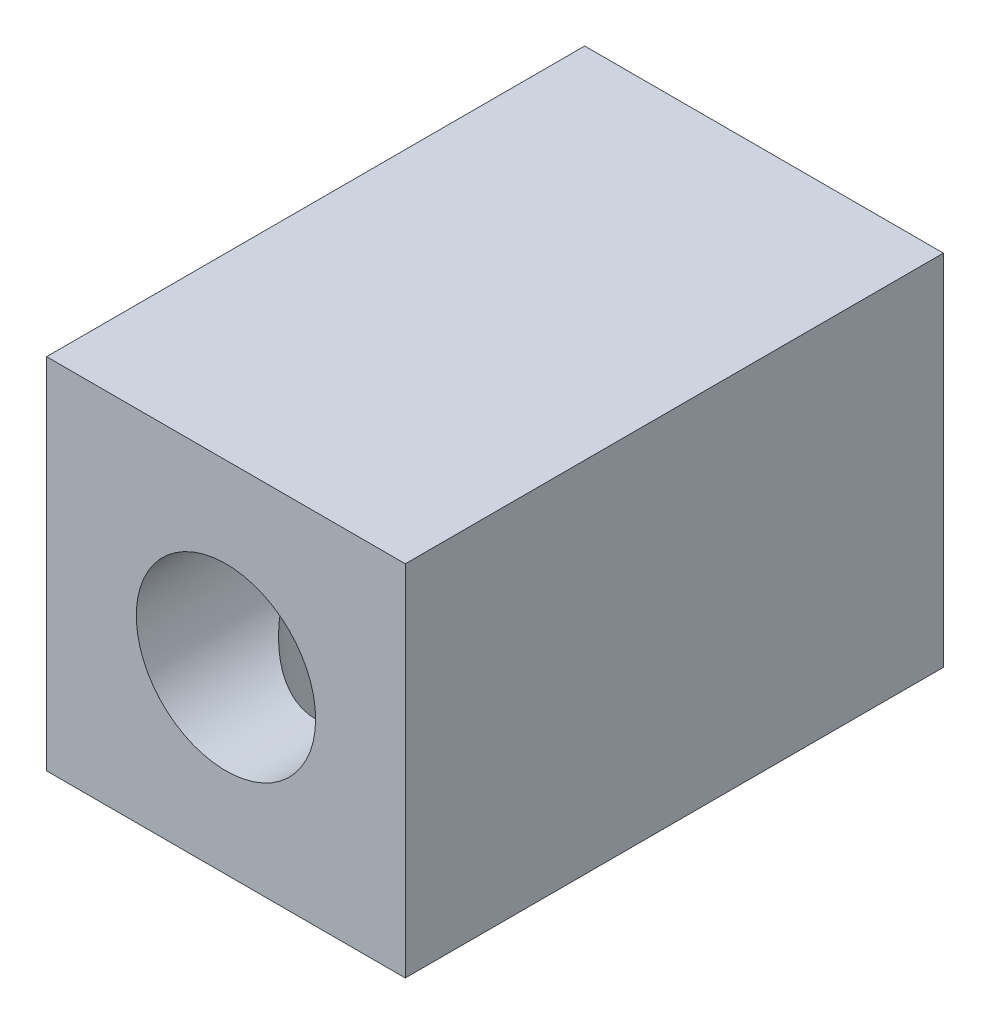
ISO-10303-21;
HEADER;
FILE_DESCRIPTION(('STEP AP214'),'2;1');
FILE_NAME('part.step','',(''),(''),'','','');
FILE_SCHEMA(('AUTOMOTIVE_DESIGN { 1 0 10303 214 1 1 1 1 }'));
ENDSEC;
DATA;
#1=APPLICATION_CONTEXT('core data for automotive mechanical design processes');
#2=APPLICATION_PROTOCOL_DEFINITION('international standard','automotive_design',2000,#1);
#3=PRODUCT_CONTEXT('',#1,'mechanical');
#4=PRODUCT('Part','Part','',(#3));
#5=PRODUCT_RELATED_PRODUCT_CATEGORY('part','',(#4));
#6=PRODUCT_DEFINITION_FORMATION('','',#4);
#7=PRODUCT_DEFINITION_CONTEXT('part definition',#1,'design');
#8=PRODUCT_DEFINITION('design','',#6,#7);
#9=PRODUCT_DEFINITION_SHAPE('','',#8);
#10=(LENGTH_UNIT() NAMED_UNIT(*) SI_UNIT(.MILLI.,.METRE.));
#11=(NAMED_UNIT(*) PLANE_ANGLE_UNIT() SI_UNIT($,.RADIAN.));
#12=(NAMED_UNIT(*) SI_UNIT($,.STERADIAN.) SOLID_ANGLE_UNIT());
#13=UNCERTAINTY_MEASURE_WITH_UNIT(LENGTH_MEASURE(1.E-05),#10,'distance_accuracy_value','');
#14=(GEOMETRIC_REPRESENTATION_CONTEXT(3) GLOBAL_UNCERTAINTY_ASSIGNED_CONTEXT((#13)) GLOBAL_UNIT_ASSIGNED_CONTEXT((#10,
#11,#12)) REPRESENTATION_CONTEXT('',''));
#15=CARTESIAN_POINT('',(0.,0.,0.));
#16=DIRECTION('',(0.,0.,1.));
#17=DIRECTION('',(1.,0.,0.));
#18=AXIS2_PLACEMENT_3D('',#15,#16,#17);
#19=CARTESIAN_POINT('',(-5.,-4.9999999999964,15.));
#20=DIRECTION('',(0.,0.,-1.00000000000002));
#21=DIRECTION('',(-1.00000000000002,0.,0.));
#22=AXIS2_PLACEMENT_3D('',#19,#20,#21);
#23=PLANE('',#22);
#24=DIRECTION('',(0.,-1.,0.));
#25=VECTOR('',#24,1.);
#26=CARTESIAN_POINT('',(-5.,-4.9999999999964,15.));
#27=LINE('',#26,#25);
#28=CARTESIAN_POINT('',(-4.99999999999995,4.99999999999995,15.));
#29=VERTEX_POINT('',#28);
#30=CARTESIAN_POINT('',(-5.,-4.9999999999964,15.));
#31=VERTEX_POINT('',#30);
#32=EDGE_CURVE('E91',#29,#31,#27,.T.);
#33=ORIENTED_EDGE('',*,*,#32,.T.);
#34=DIRECTION('',(1.00000000000002,0.,0.));
#35=VECTOR('',#34,1.);
#36=CARTESIAN_POINT('',(-5.,-4.9999999999964,15.));
#37=LINE('',#36,#35);
#38=CARTESIAN_POINT('',(5.00000000000017,-5.00000000000028,14.9999999999997));
#39=VERTEX_POINT('',#38);
#40=EDGE_CURVE('E93',#31,#39,#37,.T.);
#41=ORIENTED_EDGE('',*,*,#40,.T.);
#42=DIRECTION('',(0.,1.,0.));
#43=VECTOR('',#42,1.);
#44=CARTESIAN_POINT('',(5.00000000000017,-5.00000000000028,14.9999999999997));
#45=LINE('',#44,#43);
#46=CARTESIAN_POINT('',(4.99999999999995,4.99999999999595,14.9999999999993));
#47=VERTEX_POINT('',#46);
#48=EDGE_CURVE('E95',#39,#47,#45,.T.);
#49=ORIENTED_EDGE('',*,*,#48,.T.);
#50=DIRECTION('',(-1.00000000000002,0.,0.));
#51=VECTOR('',#50,1.);
#52=CARTESIAN_POINT('',(-4.99999999999995,4.99999999999995,15.));
#53=LINE('',#52,#51);
#54=EDGE_CURVE('E36',#47,#29,#53,.T.);
#55=ORIENTED_EDGE('',*,*,#54,.T.);
#56=EDGE_LOOP('',(#33,#41,#49,#55));
#57=FACE_BOUND('',#56,.T.);
#58=CARTESIAN_POINT('',(0.,-4.16333634234434E-12,14.9999999999998));
#59=DIRECTION('',(0.,0.,1.00000000000002));
#60=DIRECTION('',(1.00000000000002,0.,0.));
#61=AXIS2_PLACEMENT_3D('',#58,#59,#60);
#62=CIRCLE('',#61,2.5);
#63=CARTESIAN_POINT('',(2.50000000000002,-4.16259908486705E-12,14.9999999999998));
#64=VERTEX_POINT('',#63);
#65=EDGE_CURVE('E71',#64,#64,#62,.T.);
#66=ORIENTED_EDGE('',*,*,#65,.F.);
#67=EDGE_LOOP('',(#66));
#68=FACE_BOUND('',#67,.T.);
#69=ADVANCED_FACE('F16',(#57,#68),#23,.F.);
#70=CARTESIAN_POINT('',(-4.99999999999989,-5.00000000000406,-2.22044604925031E-13));
#71=DIRECTION('',(0.,0.,-1.00000000000002));
#72=DIRECTION('',(-1.00000000000002,0.,0.));
#73=AXIS2_PLACEMENT_3D('',#70,#71,#72);
#74=PLANE('',#73);
#75=DIRECTION('',(0.,-1.,0.));
#76=VECTOR('',#75,1.);
#77=CARTESIAN_POINT('',(-4.99999999999989,-5.00000000000406,-2.22044604925031E-13));
#78=LINE('',#77,#76);
#79=CARTESIAN_POINT('',(-5.00000000000009,4.99999999999601,-2.22044604925031E-13));
#80=VERTEX_POINT('',#79);
#81=CARTESIAN_POINT('',(-4.99999999999989,-5.00000000000406,-2.22044604925031E-13));
#82=VERTEX_POINT('',#81);
#83=EDGE_CURVE('E78',#80,#82,#78,.T.);
#84=ORIENTED_EDGE('',*,*,#83,.F.);
#85=DIRECTION('',(-1.00000000000002,0.,0.));
#86=VECTOR('',#85,1.);
#87=CARTESIAN_POINT('',(-5.00000000000009,4.99999999999601,-2.22044604925031E-13));
#88=LINE('',#87,#86);
#89=CARTESIAN_POINT('',(5.00000000000012,4.99999999999989,-2.22044604925031E-13));
#90=VERTEX_POINT('',#89);
#91=EDGE_CURVE('E89',#90,#80,#88,.T.);
#92=ORIENTED_EDGE('',*,*,#91,.F.);
#93=DIRECTION('',(0.,1.,0.));
#94=VECTOR('',#93,1.);
#95=CARTESIAN_POINT('',(5.,-5.00000000000006,0.));
#96=LINE('',#95,#94);
#97=CARTESIAN_POINT('',(5.,-5.00000000000006,0.));
#98=VERTEX_POINT('',#97);
#99=EDGE_CURVE('E87',#98,#90,#96,.T.);
#100=ORIENTED_EDGE('',*,*,#99,.F.);
#101=DIRECTION('',(1.00000000000002,0.,0.));
#102=VECTOR('',#101,1.);
#103=CARTESIAN_POINT('',(-4.99999999999989,-5.00000000000406,-2.22044604925031E-13));
#104=LINE('',#103,#102);
#105=EDGE_CURVE('E85',#82,#98,#104,.T.);
#106=ORIENTED_EDGE('',*,*,#105,.F.);
#107=EDGE_LOOP('',(#84,#92,#100,#106));
#108=FACE_BOUND('',#107,.T.);
#109=CARTESIAN_POINT('',(0.,-3.71924713249427E-12,1.59594559789866E-13));
#110=DIRECTION('',(0.,0.,1.00000000000002));
#111=DIRECTION('',(1.00000000000002,0.,0.));
#112=AXIS2_PLACEMENT_3D('',#109,#110,#111);
#113=CIRCLE('',#112,2.5);
#114=CARTESIAN_POINT('',(2.49999999999997,-3.71850987501698E-12,1.58501684000001E-13));
#115=VERTEX_POINT('',#114);
#116=EDGE_CURVE('E74',#115,#115,#113,.T.);
#117=ORIENTED_EDGE('',*,*,#116,.T.);
#118=EDGE_LOOP('',(#117));
#119=FACE_BOUND('',#118,.T.);
#120=ADVANCED_FACE('F117',(#108,#119),#74,.T.);
#121=CARTESIAN_POINT('',(-5.,-4.9999999999964,15.));
#122=DIRECTION('',(1.00000000000002,0.,0.));
#123=DIRECTION('',(0.,0.,-1.00000000000002));
#124=AXIS2_PLACEMENT_3D('',#121,#122,#123);
#125=PLANE('',#124);
#126=ORIENTED_EDGE('',*,*,#83,.T.);
#127=DIRECTION('',(0.,0.,-1.00000000000002));
#128=VECTOR('',#127,1.);
#129=CARTESIAN_POINT('',(-5.,-4.9999999999964,15.));
#130=LINE('',#129,#128);
#131=EDGE_CURVE('E62',#31,#82,#130,.T.);
#132=ORIENTED_EDGE('',*,*,#131,.F.);
#133=ORIENTED_EDGE('',*,*,#32,.F.);
#134=DIRECTION('',(0.,0.,-1.00000000000002));
#135=VECTOR('',#134,1.);
#136=CARTESIAN_POINT('',(-4.99999999999995,4.99999999999995,15.));
#137=LINE('',#136,#135);
#138=EDGE_CURVE('E98',#29,#80,#137,.T.);
#139=ORIENTED_EDGE('',*,*,#138,.T.);
#140=EDGE_LOOP('',(#126,#132,#133,#139));
#141=FACE_BOUND('',#140,.T.);
#142=ADVANCED_FACE('F18',(#141),#125,.F.);
#143=CARTESIAN_POINT('',(-5.,-4.9999999999964,15.));
#144=DIRECTION('',(0.,1.,0.));
#145=DIRECTION('',(0.,0.,1.00000000000002));
#146=AXIS2_PLACEMENT_3D('',#143,#144,#145);
#147=PLANE('',#146);
#148=CARTESIAN_POINT('',(0.,-5.00000000000034,9.9999999999999));
#149=DIRECTION('',(0.,1.,0.));
#150=DIRECTION('',(0.,0.,1.00000000000002));
#151=AXIS2_PLACEMENT_3D('',#148,#149,#150);
#152=CIRCLE('',#151,2.5);
#153=CARTESIAN_POINT('',(0.,-5.00000000000034,12.5));
#154=VERTEX_POINT('',#153);
#155=EDGE_CURVE('E76',#154,#154,#152,.T.);
#156=ORIENTED_EDGE('',*,*,#155,.T.);
#157=EDGE_LOOP('',(#156));
#158=FACE_BOUND('',#157,.T.);
#159=ORIENTED_EDGE('',*,*,#105,.T.);
#160=DIRECTION('',(0.,0.,-1.00000000000002));
#161=VECTOR('',#160,1.);
#162=CARTESIAN_POINT('',(5.00000000000017,-5.00000000000028,14.9999999999997));
#163=LINE('',#162,#161);
#164=EDGE_CURVE('E104',#39,#98,#163,.T.);
#165=ORIENTED_EDGE('',*,*,#164,.F.);
#166=ORIENTED_EDGE('',*,*,#40,.F.);
#167=ORIENTED_EDGE('',*,*,#131,.T.);
#168=EDGE_LOOP('',(#159,#165,#166,#167));
#169=FACE_BOUND('',#168,.T.);
#170=ADVANCED_FACE('F110',(#158,#169),#147,.F.);
#171=CARTESIAN_POINT('',(5.00000000000017,-5.00000000000028,14.9999999999997));
#172=DIRECTION('',(-1.00000000000002,0.,0.));
#173=DIRECTION('',(0.,0.,1.00000000000002));
#174=AXIS2_PLACEMENT_3D('',#171,#172,#173);
#175=PLANE('',#174);
#176=ORIENTED_EDGE('',*,*,#99,.T.);
#177=DIRECTION('',(0.,0.,-1.00000000000002));
#178=VECTOR('',#177,1.);
#179=CARTESIAN_POINT('',(4.99999999999995,4.99999999999595,14.9999999999993));
#180=LINE('',#179,#178);
#181=EDGE_CURVE('E101',#47,#90,#180,.T.);
#182=ORIENTED_EDGE('',*,*,#181,.F.);
#183=ORIENTED_EDGE('',*,*,#48,.F.);
#184=ORIENTED_EDGE('',*,*,#164,.T.);
#185=EDGE_LOOP('',(#176,#182,#183,#184));
#186=FACE_BOUND('',#185,.T.);
#187=ADVANCED_FACE('F121',(#186),#175,.F.);
#188=CARTESIAN_POINT('',(-4.99999999999995,4.99999999999995,15.));
#189=DIRECTION('',(0.,-1.,0.));
#190=DIRECTION('',(1.00000000000002,0.,0.));
#191=AXIS2_PLACEMENT_3D('',#188,#189,#190);
#192=PLANE('',#191);
#193=ORIENTED_EDGE('',*,*,#91,.T.);
#194=ORIENTED_EDGE('',*,*,#138,.F.);
#195=ORIENTED_EDGE('',*,*,#54,.F.);
#196=ORIENTED_EDGE('',*,*,#181,.T.);
#197=EDGE_LOOP('',(#193,#194,#195,#196));
#198=FACE_BOUND('',#197,.T.);
#199=ADVANCED_FACE('F66',(#198),#192,.F.);
#200=CARTESIAN_POINT('',(0.,-4.16333634234434E-12,14.9999999999998));
#201=DIRECTION('',(0.,0.,-1.00000000000002));
#202=DIRECTION('',(-1.00000000000002,0.,0.));
#203=AXIS2_PLACEMENT_3D('',#200,#201,#202);
#204=CYLINDRICAL_SURFACE('',#203,2.5);
#205=CARTESIAN_POINT('',(1.38777878078145E-13,-3.99680288865056E-12,9.99999999999981));
#206=DIRECTION('',(0.,0.707106781186558,-0.707106781186566));
#207=DIRECTION('',(0.,-0.707106781186554,-0.707106781186565));
#208=AXIS2_PLACEMENT_3D('',#205,#206,#207);
#209=ELLIPSE('',#208,3.53553390593274,2.5);
#210=CARTESIAN_POINT('',(2.49999999999989,-7.7715611723761E-12,9.99999999999992));
#211=VERTEX_POINT('',#210);
#212=CARTESIAN_POINT('',(-2.49999999999995,-3.88578058618805E-12,10.));
#213=VERTEX_POINT('',#212);
#214=EDGE_CURVE('E11',#211,#213,#209,.T.);
#215=ORIENTED_EDGE('',*,*,#214,.F.);
#216=CARTESIAN_POINT('',(1.38777878078145E-13,-3.99680288865056E-12,9.99999999999981));
#217=DIRECTION('',(0.,-0.707106781186554,-0.707106781186565));
#218=DIRECTION('',(0.,0.707106781186558,-0.707106781186566));
#219=AXIS2_PLACEMENT_3D('',#216,#217,#218);
#220=ELLIPSE('',#219,3.53553390593274,2.5);
#221=EDGE_CURVE('E24',#213,#211,#220,.F.);
#222=ORIENTED_EDGE('',*,*,#221,.F.);
#223=EDGE_LOOP('',(#215,#222));
#224=FACE_BOUND('',#223,.T.);
#225=ORIENTED_EDGE('',*,*,#65,.T.);
#226=EDGE_LOOP('',(#225));
#227=FACE_BOUND('',#226,.T.);
#228=ORIENTED_EDGE('',*,*,#116,.F.);
#229=EDGE_LOOP('',(#228));
#230=FACE_BOUND('',#229,.T.);
#231=ADVANCED_FACE('F63',(#224,#227,#230),#204,.F.);
#232=CARTESIAN_POINT('',(0.,-5.00000000000034,9.9999999999999));
#233=DIRECTION('',(0.,1.,0.));
#234=DIRECTION('',(0.,0.,1.00000000000002));
#235=AXIS2_PLACEMENT_3D('',#232,#233,#234);
#236=CYLINDRICAL_SURFACE('',#235,2.5);
#237=ORIENTED_EDGE('',*,*,#214,.T.);
#238=ORIENTED_EDGE('',*,*,#221,.T.);
#239=EDGE_LOOP('',(#237,#238));
#240=FACE_BOUND('',#239,.T.);
#241=ORIENTED_EDGE('',*,*,#155,.F.);
#242=EDGE_LOOP('',(#241));
#243=FACE_BOUND('',#242,.T.);
#244=ADVANCED_FACE('F59',(#240,#243),#236,.F.);
#245=CLOSED_SHELL('',(#69,#120,#142,#170,#187,#199,#231,#244));
#246=MANIFOLD_SOLID_BREP('B1',#245);
#247=ADVANCED_BREP_SHAPE_REPRESENTATION('',(#18,#246),#14);
#248=SHAPE_DEFINITION_REPRESENTATION(#9,#247);
ENDSEC;
END-ISO-10303-21;
